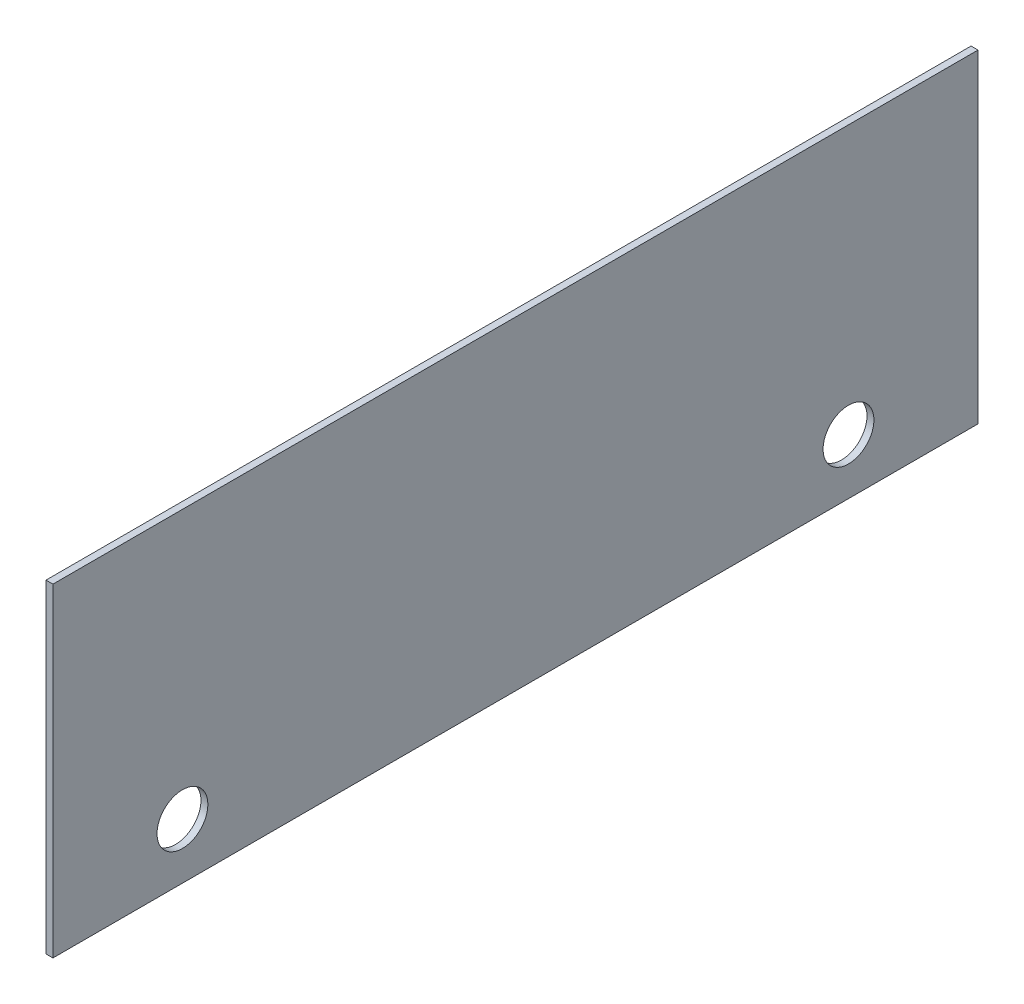
ISO-10303-21;
HEADER;
FILE_DESCRIPTION(('STEP AP214'),'2;1');
FILE_NAME('part.step','',(''),(''),'','','');
FILE_SCHEMA(('AUTOMOTIVE_DESIGN { 1 0 10303 214 1 1 1 1 }'));
ENDSEC;
DATA;
#1=APPLICATION_CONTEXT('core data for automotive mechanical design processes');
#2=APPLICATION_PROTOCOL_DEFINITION('international standard','automotive_design',2000,#1);
#3=PRODUCT_CONTEXT('',#1,'mechanical');
#4=PRODUCT('Part','Part','',(#3));
#5=PRODUCT_RELATED_PRODUCT_CATEGORY('part','',(#4));
#6=PRODUCT_DEFINITION_FORMATION('','',#4);
#7=PRODUCT_DEFINITION_CONTEXT('part definition',#1,'design');
#8=PRODUCT_DEFINITION('design','',#6,#7);
#9=PRODUCT_DEFINITION_SHAPE('','',#8);
#10=(LENGTH_UNIT() NAMED_UNIT(*) SI_UNIT(.MILLI.,.METRE.));
#11=(NAMED_UNIT(*) PLANE_ANGLE_UNIT() SI_UNIT($,.RADIAN.));
#12=(NAMED_UNIT(*) SI_UNIT($,.STERADIAN.) SOLID_ANGLE_UNIT());
#13=UNCERTAINTY_MEASURE_WITH_UNIT(LENGTH_MEASURE(1.E-05),#10,'distance_accuracy_value','');
#14=(GEOMETRIC_REPRESENTATION_CONTEXT(3) GLOBAL_UNCERTAINTY_ASSIGNED_CONTEXT((#13)) GLOBAL_UNIT_ASSIGNED_CONTEXT((#10,
#11,#12)) REPRESENTATION_CONTEXT('',''));
#15=CARTESIAN_POINT('',(0.,0.,0.));
#16=DIRECTION('',(0.,0.,1.));
#17=DIRECTION('',(1.,0.,0.));
#18=AXIS2_PLACEMENT_3D('',#15,#16,#17);
#19=CARTESIAN_POINT('',(0.,0.,635.));
#20=DIRECTION('',(1.,0.,0.));
#21=DIRECTION('',(0.,0.,-1.));
#22=AXIS2_PLACEMENT_3D('',#19,#20,#21);
#23=PLANE('',#22);
#24=CARTESIAN_POINT('',(0.,38.1,88.9));
#25=DIRECTION('',(1.,0.,0.));
#26=DIRECTION('',(0.,0.,-1.));
#27=AXIS2_PLACEMENT_3D('',#24,#25,#26);
#28=CIRCLE('',#27,17.45);
#29=CARTESIAN_POINT('',(0.,38.1,71.45));
#30=VERTEX_POINT('',#29);
#31=EDGE_CURVE('E115',#30,#30,#28,.T.);
#32=ORIENTED_EDGE('',*,*,#31,.T.);
#33=EDGE_LOOP('',(#32));
#34=FACE_BOUND('',#33,.T.);
#35=CARTESIAN_POINT('',(0.,38.1,546.1));
#36=DIRECTION('',(1.,0.,0.));
#37=DIRECTION('',(0.,0.,-1.));
#38=AXIS2_PLACEMENT_3D('',#35,#36,#37);
#39=CIRCLE('',#38,17.4499999999999);
#40=CARTESIAN_POINT('',(0.,38.1,528.65));
#41=VERTEX_POINT('',#40);
#42=EDGE_CURVE('E101',#41,#41,#39,.T.);
#43=ORIENTED_EDGE('',*,*,#42,.T.);
#44=EDGE_LOOP('',(#43));
#45=FACE_BOUND('',#44,.T.);
#46=DIRECTION('',(0.,-1.,0.));
#47=VECTOR('',#46,1.);
#48=CARTESIAN_POINT('',(0.,0.,0.));
#49=LINE('',#48,#47);
#50=CARTESIAN_POINT('',(0.,222.25,0.));
#51=VERTEX_POINT('',#50);
#52=CARTESIAN_POINT('',(0.,0.,0.));
#53=VERTEX_POINT('',#52);
#54=EDGE_CURVE('E98',#51,#53,#49,.T.);
#55=ORIENTED_EDGE('',*,*,#54,.T.);
#56=DIRECTION('',(0.,0.,-1.));
#57=VECTOR('',#56,1.);
#58=CARTESIAN_POINT('',(0.,0.,635.));
#59=LINE('',#58,#57);
#60=CARTESIAN_POINT('',(0.,0.,635.));
#61=VERTEX_POINT('',#60);
#62=EDGE_CURVE('E11',#61,#53,#59,.T.);
#63=ORIENTED_EDGE('',*,*,#62,.F.);
#64=DIRECTION('',(0.,-1.,0.));
#65=VECTOR('',#64,1.);
#66=CARTESIAN_POINT('',(0.,0.,635.));
#67=LINE('',#66,#65);
#68=CARTESIAN_POINT('',(0.,222.25,635.));
#69=VERTEX_POINT('',#68);
#70=EDGE_CURVE('E86',#69,#61,#67,.T.);
#71=ORIENTED_EDGE('',*,*,#70,.F.);
#72=DIRECTION('',(0.,0.,-1.));
#73=VECTOR('',#72,1.);
#74=CARTESIAN_POINT('',(0.,222.25,635.));
#75=LINE('',#74,#73);
#76=EDGE_CURVE('E94',#69,#51,#75,.T.);
#77=ORIENTED_EDGE('',*,*,#76,.T.);
#78=EDGE_LOOP('',(#55,#63,#71,#77));
#79=FACE_BOUND('',#78,.T.);
#80=ADVANCED_FACE('F35',(#34,#45,#79),#23,.F.);
#81=CARTESIAN_POINT('',(0.,0.,635.));
#82=DIRECTION('',(0.,1.,0.));
#83=DIRECTION('',(0.,0.,1.));
#84=AXIS2_PLACEMENT_3D('',#81,#82,#83);
#85=PLANE('',#84);
#86=DIRECTION('',(1.,0.,0.));
#87=VECTOR('',#86,1.);
#88=CARTESIAN_POINT('',(0.,0.,0.));
#89=LINE('',#88,#87);
#90=CARTESIAN_POINT('',(4.7625,0.,0.));
#91=VERTEX_POINT('',#90);
#92=EDGE_CURVE('E90',#53,#91,#89,.T.);
#93=ORIENTED_EDGE('',*,*,#92,.T.);
#94=DIRECTION('',(0.,0.,-1.));
#95=VECTOR('',#94,1.);
#96=CARTESIAN_POINT('',(4.7625,0.,635.));
#97=LINE('',#96,#95);
#98=CARTESIAN_POINT('',(4.7625,0.,635.));
#99=VERTEX_POINT('',#98);
#100=EDGE_CURVE('E43',#99,#91,#97,.T.);
#101=ORIENTED_EDGE('',*,*,#100,.F.);
#102=DIRECTION('',(1.,0.,0.));
#103=VECTOR('',#102,1.);
#104=CARTESIAN_POINT('',(0.,0.,635.));
#105=LINE('',#104,#103);
#106=EDGE_CURVE('E81',#61,#99,#105,.T.);
#107=ORIENTED_EDGE('',*,*,#106,.F.);
#108=ORIENTED_EDGE('',*,*,#62,.T.);
#109=EDGE_LOOP('',(#93,#101,#107,#108));
#110=FACE_BOUND('',#109,.T.);
#111=ADVANCED_FACE('F89',(#110),#85,.F.);
#112=CARTESIAN_POINT('',(4.7625,0.,635.));
#113=DIRECTION('',(-1.,0.,0.));
#114=DIRECTION('',(0.,0.,1.));
#115=AXIS2_PLACEMENT_3D('',#112,#113,#114);
#116=PLANE('',#115);
#117=CARTESIAN_POINT('',(4.7625,38.1,88.9));
#118=DIRECTION('',(1.,0.,0.));
#119=DIRECTION('',(0.,0.,-1.));
#120=AXIS2_PLACEMENT_3D('',#117,#118,#119);
#121=CIRCLE('',#120,17.45);
#122=CARTESIAN_POINT('',(4.7625,38.1,71.45));
#123=VERTEX_POINT('',#122);
#124=EDGE_CURVE('E118',#123,#123,#121,.T.);
#125=ORIENTED_EDGE('',*,*,#124,.F.);
#126=EDGE_LOOP('',(#125));
#127=FACE_BOUND('',#126,.T.);
#128=CARTESIAN_POINT('',(4.7625,38.1,546.1));
#129=DIRECTION('',(1.,0.,0.));
#130=DIRECTION('',(0.,0.,-1.));
#131=AXIS2_PLACEMENT_3D('',#128,#129,#130);
#132=CIRCLE('',#131,17.4499999999999);
#133=CARTESIAN_POINT('',(4.7625,38.1,528.65));
#134=VERTEX_POINT('',#133);
#135=EDGE_CURVE('E112',#134,#134,#132,.T.);
#136=ORIENTED_EDGE('',*,*,#135,.F.);
#137=EDGE_LOOP('',(#136));
#138=FACE_BOUND('',#137,.T.);
#139=DIRECTION('',(0.,1.,0.));
#140=VECTOR('',#139,1.);
#141=CARTESIAN_POINT('',(4.7625,0.,0.));
#142=LINE('',#141,#140);
#143=CARTESIAN_POINT('',(4.7625,222.25,0.));
#144=VERTEX_POINT('',#143);
#145=EDGE_CURVE('E68',#91,#144,#142,.T.);
#146=ORIENTED_EDGE('',*,*,#145,.T.);
#147=DIRECTION('',(0.,0.,-1.));
#148=VECTOR('',#147,1.);
#149=CARTESIAN_POINT('',(4.7625,222.25,635.));
#150=LINE('',#149,#148);
#151=CARTESIAN_POINT('',(4.7625,222.25,635.));
#152=VERTEX_POINT('',#151);
#153=EDGE_CURVE('E91',#152,#144,#150,.T.);
#154=ORIENTED_EDGE('',*,*,#153,.F.);
#155=DIRECTION('',(0.,1.,0.));
#156=VECTOR('',#155,1.);
#157=CARTESIAN_POINT('',(4.7625,0.,635.));
#158=LINE('',#157,#156);
#159=EDGE_CURVE('E84',#99,#152,#158,.T.);
#160=ORIENTED_EDGE('',*,*,#159,.F.);
#161=ORIENTED_EDGE('',*,*,#100,.T.);
#162=EDGE_LOOP('',(#146,#154,#160,#161));
#163=FACE_BOUND('',#162,.T.);
#164=ADVANCED_FACE('F92',(#127,#138,#163),#116,.F.);
#165=CARTESIAN_POINT('',(0.,222.25,635.));
#166=DIRECTION('',(0.,-1.,0.));
#167=DIRECTION('',(0.,0.,-1.));
#168=AXIS2_PLACEMENT_3D('',#165,#166,#167);
#169=PLANE('',#168);
#170=DIRECTION('',(-1.,0.,0.));
#171=VECTOR('',#170,1.);
#172=CARTESIAN_POINT('',(0.,222.25,0.));
#173=LINE('',#172,#171);
#174=EDGE_CURVE('E74',#144,#51,#173,.T.);
#175=ORIENTED_EDGE('',*,*,#174,.T.);
#176=ORIENTED_EDGE('',*,*,#76,.F.);
#177=DIRECTION('',(-1.,0.,0.));
#178=VECTOR('',#177,1.);
#179=CARTESIAN_POINT('',(0.,222.25,635.));
#180=LINE('',#179,#178);
#181=EDGE_CURVE('E51',#152,#69,#180,.T.);
#182=ORIENTED_EDGE('',*,*,#181,.F.);
#183=ORIENTED_EDGE('',*,*,#153,.T.);
#184=EDGE_LOOP('',(#175,#176,#182,#183));
#185=FACE_BOUND('',#184,.T.);
#186=ADVANCED_FACE('F106',(#185),#169,.F.);
#187=CARTESIAN_POINT('',(0.,0.,635.));
#188=DIRECTION('',(0.,0.,-1.));
#189=DIRECTION('',(-1.,0.,0.));
#190=AXIS2_PLACEMENT_3D('',#187,#188,#189);
#191=PLANE('',#190);
#192=ORIENTED_EDGE('',*,*,#70,.T.);
#193=ORIENTED_EDGE('',*,*,#106,.T.);
#194=ORIENTED_EDGE('',*,*,#159,.T.);
#195=ORIENTED_EDGE('',*,*,#181,.T.);
#196=EDGE_LOOP('',(#192,#193,#194,#195));
#197=FACE_BOUND('',#196,.T.);
#198=ADVANCED_FACE('F82',(#197),#191,.F.);
#199=CARTESIAN_POINT('',(0.,0.,0.));
#200=DIRECTION('',(0.,0.,-1.));
#201=DIRECTION('',(-1.,0.,0.));
#202=AXIS2_PLACEMENT_3D('',#199,#200,#201);
#203=PLANE('',#202);
#204=ORIENTED_EDGE('',*,*,#54,.F.);
#205=ORIENTED_EDGE('',*,*,#174,.F.);
#206=ORIENTED_EDGE('',*,*,#145,.F.);
#207=ORIENTED_EDGE('',*,*,#92,.F.);
#208=EDGE_LOOP('',(#204,#205,#206,#207));
#209=FACE_BOUND('',#208,.T.);
#210=ADVANCED_FACE('F109',(#209),#203,.T.);
#211=CARTESIAN_POINT('',(0.,38.1,546.1));
#212=DIRECTION('',(1.,0.,0.));
#213=DIRECTION('',(0.,0.,-1.));
#214=AXIS2_PLACEMENT_3D('',#211,#212,#213);
#215=CYLINDRICAL_SURFACE('',#214,17.4499999999999);
#216=ORIENTED_EDGE('',*,*,#42,.F.);
#217=EDGE_LOOP('',(#216));
#218=FACE_BOUND('',#217,.T.);
#219=ORIENTED_EDGE('',*,*,#135,.T.);
#220=EDGE_LOOP('',(#219));
#221=FACE_BOUND('',#220,.T.);
#222=ADVANCED_FACE('F129',(#218,#221),#215,.F.);
#223=CARTESIAN_POINT('',(0.,38.1,88.9));
#224=DIRECTION('',(1.,0.,0.));
#225=DIRECTION('',(0.,0.,-1.));
#226=AXIS2_PLACEMENT_3D('',#223,#224,#225);
#227=CYLINDRICAL_SURFACE('',#226,17.45);
#228=ORIENTED_EDGE('',*,*,#31,.F.);
#229=EDGE_LOOP('',(#228));
#230=FACE_BOUND('',#229,.T.);
#231=ORIENTED_EDGE('',*,*,#124,.T.);
#232=EDGE_LOOP('',(#231));
#233=FACE_BOUND('',#232,.T.);
#234=ADVANCED_FACE('F126',(#230,#233),#227,.F.);
#235=CLOSED_SHELL('',(#80,#111,#164,#186,#198,#210,#222,#234));
#236=MANIFOLD_SOLID_BREP('B2',#235);
#237=ADVANCED_BREP_SHAPE_REPRESENTATION('',(#18,#236),#14);
#238=SHAPE_DEFINITION_REPRESENTATION(#9,#237);
ENDSEC;
END-ISO-10303-21;
